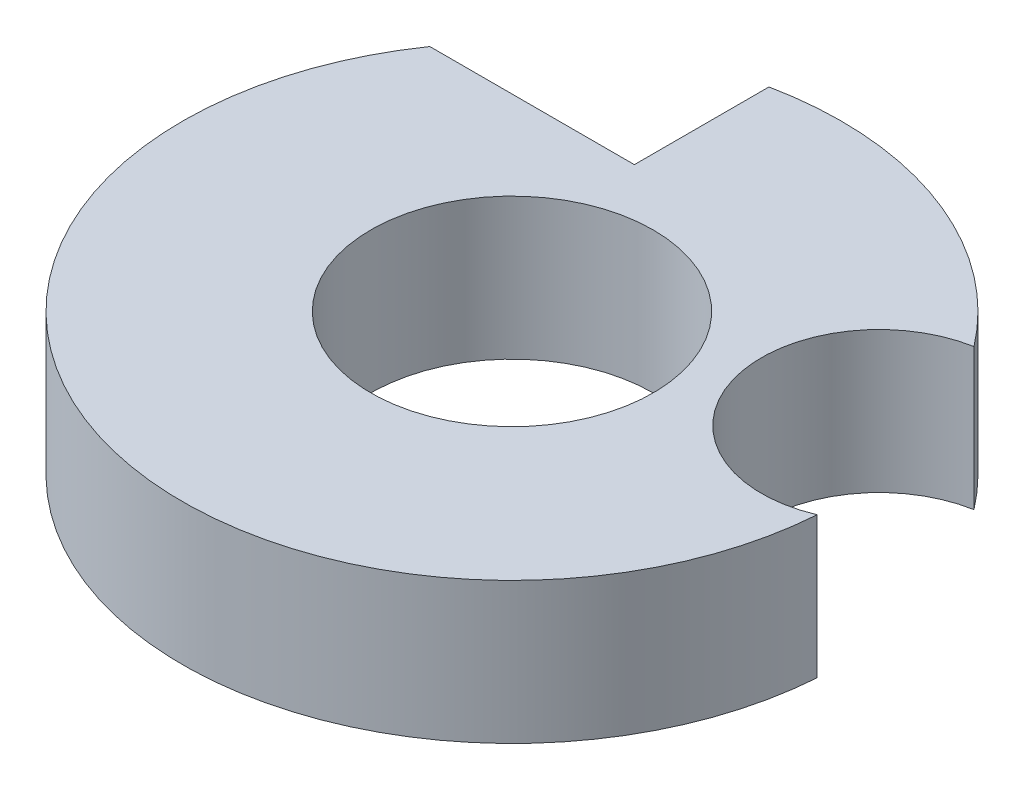
ISO-10303-21;
HEADER;
FILE_DESCRIPTION(('STEP AP214'),'2;1');
FILE_NAME('part.step','',(''),(''),'','','');
FILE_SCHEMA(('AUTOMOTIVE_DESIGN { 1 0 10303 214 1 1 1 1 }'));
ENDSEC;
DATA;
#1=APPLICATION_CONTEXT('core data for automotive mechanical design processes');
#2=APPLICATION_PROTOCOL_DEFINITION('international standard','automotive_design',2000,#1);
#3=PRODUCT_CONTEXT('',#1,'mechanical');
#4=PRODUCT('Part','Part','',(#3));
#5=PRODUCT_RELATED_PRODUCT_CATEGORY('part','',(#4));
#6=PRODUCT_DEFINITION_FORMATION('','',#4);
#7=PRODUCT_DEFINITION_CONTEXT('part definition',#1,'design');
#8=PRODUCT_DEFINITION('design','',#6,#7);
#9=PRODUCT_DEFINITION_SHAPE('','',#8);
#10=(LENGTH_UNIT() NAMED_UNIT(*) SI_UNIT(.MILLI.,.METRE.));
#11=(NAMED_UNIT(*) PLANE_ANGLE_UNIT() SI_UNIT($,.RADIAN.));
#12=(NAMED_UNIT(*) SI_UNIT($,.STERADIAN.) SOLID_ANGLE_UNIT());
#13=UNCERTAINTY_MEASURE_WITH_UNIT(LENGTH_MEASURE(1.E-05),#10,'distance_accuracy_value','');
#14=(GEOMETRIC_REPRESENTATION_CONTEXT(3) GLOBAL_UNCERTAINTY_ASSIGNED_CONTEXT((#13)) GLOBAL_UNIT_ASSIGNED_CONTEXT((#10,
#11,#12)) REPRESENTATION_CONTEXT('',''));
#15=CARTESIAN_POINT('',(0.,0.,0.));
#16=DIRECTION('',(0.,0.,1.));
#17=DIRECTION('',(1.,0.,0.));
#18=AXIS2_PLACEMENT_3D('',#15,#16,#17);
#19=CARTESIAN_POINT('',(0.,0.,0.));
#20=DIRECTION('',(0.,-1.,0.));
#21=DIRECTION('',(0.,0.,-1.));
#22=AXIS2_PLACEMENT_3D('',#19,#20,#21);
#23=CYLINDRICAL_SURFACE('',#22,3.5);
#24=DIRECTION('',(0.,1.,0.));
#25=VECTOR('',#24,1.);
#26=CARTESIAN_POINT('',(3.49109659244381,0.,0.249488641479367));
#27=LINE('',#26,#25);
#28=CARTESIAN_POINT('',(3.49109659244381,0.,0.249488641479367));
#29=VERTEX_POINT('',#28);
#30=CARTESIAN_POINT('',(3.49109659244381,1.5,0.249488641479367));
#31=VERTEX_POINT('',#30);
#32=EDGE_CURVE('E46',#29,#31,#27,.T.);
#33=ORIENTED_EDGE('',*,*,#32,.T.);
#34=CARTESIAN_POINT('',(0.,1.5,0.));
#35=DIRECTION('',(0.,-1.,0.));
#36=DIRECTION('',(0.,0.,-1.));
#37=AXIS2_PLACEMENT_3D('',#34,#35,#36);
#38=CIRCLE('',#37,3.5);
#39=CARTESIAN_POINT('',(-2.87228132326901,1.5,-2.));
#40=VERTEX_POINT('',#39);
#41=EDGE_CURVE('E96',#31,#40,#38,.T.);
#42=ORIENTED_EDGE('',*,*,#41,.T.);
#43=DIRECTION('',(0.,1.,0.));
#44=VECTOR('',#43,1.);
#45=CARTESIAN_POINT('',(-2.87228132326901,0.,-2.));
#46=LINE('',#45,#44);
#47=CARTESIAN_POINT('',(-2.87228132326901,0.,-2.));
#48=VERTEX_POINT('',#47);
#49=EDGE_CURVE('E103',#48,#40,#46,.T.);
#50=ORIENTED_EDGE('',*,*,#49,.F.);
#51=CARTESIAN_POINT('',(0.,0.,0.));
#52=DIRECTION('',(0.,-1.,0.));
#53=DIRECTION('',(0.,0.,-1.));
#54=AXIS2_PLACEMENT_3D('',#51,#52,#53);
#55=CIRCLE('',#54,3.5);
#56=EDGE_CURVE('E97',#29,#48,#55,.T.);
#57=ORIENTED_EDGE('',*,*,#56,.F.);
#58=EDGE_LOOP('',(#33,#42,#50,#57));
#59=FACE_BOUND('',#58,.T.);
#60=ADVANCED_FACE('F31',(#59),#23,.T.);
#61=CARTESIAN_POINT('',(1.5,1.5,0.));
#62=DIRECTION('',(0.,1.,0.));
#63=DIRECTION('',(0.,0.,1.));
#64=AXIS2_PLACEMENT_3D('',#61,#62,#63);
#65=PLANE('',#64);
#66=CARTESIAN_POINT('',(3.,1.5,-0.9));
#67=DIRECTION('',(0.,1.,0.));
#68=DIRECTION('',(0.,0.,1.));
#69=AXIS2_PLACEMENT_3D('',#66,#67,#68);
#70=CIRCLE('',#69,1.25);
#71=CARTESIAN_POINT('',(2.7772520314094,1.5,-2.12999322863533));
#72=VERTEX_POINT('',#71);
#73=EDGE_CURVE('E83',#72,#31,#70,.T.);
#74=ORIENTED_EDGE('',*,*,#73,.F.);
#75=CARTESIAN_POINT('',(-0.7,1.5,-3.42928563989645));
#76=VERTEX_POINT('',#75);
#77=EDGE_CURVE('E39',#76,#72,#38,.T.);
#78=ORIENTED_EDGE('',*,*,#77,.F.);
#79=DIRECTION('',(0.,0.,1.));
#80=VECTOR('',#79,1.);
#81=CARTESIAN_POINT('',(-0.7,1.5,0.));
#82=LINE('',#81,#80);
#83=CARTESIAN_POINT('',(-0.7,1.5,-2.));
#84=VERTEX_POINT('',#83);
#85=EDGE_CURVE('E109',#76,#84,#82,.T.);
#86=ORIENTED_EDGE('',*,*,#85,.T.);
#87=DIRECTION('',(-1.,0.,0.));
#88=VECTOR('',#87,1.);
#89=CARTESIAN_POINT('',(-7.84142135623731,1.5,-2.));
#90=LINE('',#89,#88);
#91=EDGE_CURVE('E113',#84,#40,#90,.T.);
#92=ORIENTED_EDGE('',*,*,#91,.T.);
#93=ORIENTED_EDGE('',*,*,#41,.F.);
#94=EDGE_LOOP('',(#74,#78,#86,#92,#93));
#95=FACE_BOUND('',#94,.T.);
#96=CARTESIAN_POINT('',(0.,1.5,0.));
#97=DIRECTION('',(0.,-1.,0.));
#98=DIRECTION('',(0.,0.,-1.));
#99=AXIS2_PLACEMENT_3D('',#96,#97,#98);
#100=CIRCLE('',#99,1.5);
#101=CARTESIAN_POINT('',(0.,1.5,-1.5));
#102=VERTEX_POINT('',#101);
#103=EDGE_CURVE('E11',#102,#102,#100,.T.);
#104=ORIENTED_EDGE('',*,*,#103,.T.);
#105=EDGE_LOOP('',(#104));
#106=FACE_BOUND('',#105,.T.);
#107=ADVANCED_FACE('F124',(#95,#106),#65,.T.);
#108=DIRECTION('',(0.,1.,0.));
#109=VECTOR('',#108,1.);
#110=CARTESIAN_POINT('',(2.7772520314094,0.,-2.12999322863533));
#111=LINE('',#110,#109);
#112=CARTESIAN_POINT('',(2.7772520314094,0.,-2.12999322863533));
#113=VERTEX_POINT('',#112);
#114=EDGE_CURVE('E78',#113,#72,#111,.T.);
#115=ORIENTED_EDGE('',*,*,#114,.F.);
#116=CARTESIAN_POINT('',(-0.7,0.,-3.42928563989645));
#117=VERTEX_POINT('',#116);
#118=EDGE_CURVE('E89',#117,#113,#55,.T.);
#119=ORIENTED_EDGE('',*,*,#118,.F.);
#120=DIRECTION('',(0.,1.,0.));
#121=VECTOR('',#120,1.);
#122=CARTESIAN_POINT('',(-0.7,0.,-3.42928563989645));
#123=LINE('',#122,#121);
#124=EDGE_CURVE('E54',#117,#76,#123,.T.);
#125=ORIENTED_EDGE('',*,*,#124,.T.);
#126=ORIENTED_EDGE('',*,*,#77,.T.);
#127=EDGE_LOOP('',(#115,#119,#125,#126));
#128=FACE_BOUND('',#127,.T.);
#129=ADVANCED_FACE('F88',(#128),#23,.T.);
#130=CARTESIAN_POINT('',(1.5,0.,0.));
#131=DIRECTION('',(0.,-1.,0.));
#132=DIRECTION('',(0.,0.,-1.));
#133=AXIS2_PLACEMENT_3D('',#130,#131,#132);
#134=PLANE('',#133);
#135=CARTESIAN_POINT('',(3.,0.,-0.9));
#136=DIRECTION('',(0.,1.,0.));
#137=DIRECTION('',(0.,0.,1.));
#138=AXIS2_PLACEMENT_3D('',#135,#136,#137);
#139=CIRCLE('',#138,1.25);
#140=EDGE_CURVE('E75',#113,#29,#139,.T.);
#141=ORIENTED_EDGE('',*,*,#140,.T.);
#142=ORIENTED_EDGE('',*,*,#56,.T.);
#143=DIRECTION('',(-1.,0.,0.));
#144=VECTOR('',#143,1.);
#145=CARTESIAN_POINT('',(-7.84142135623731,0.,-2.));
#146=LINE('',#145,#144);
#147=CARTESIAN_POINT('',(-0.7,0.,-2.));
#148=VERTEX_POINT('',#147);
#149=EDGE_CURVE('E112',#148,#48,#146,.T.);
#150=ORIENTED_EDGE('',*,*,#149,.F.);
#151=DIRECTION('',(0.,0.,1.));
#152=VECTOR('',#151,1.);
#153=CARTESIAN_POINT('',(-0.7,0.,0.));
#154=LINE('',#153,#152);
#155=EDGE_CURVE('E95',#117,#148,#154,.T.);
#156=ORIENTED_EDGE('',*,*,#155,.F.);
#157=ORIENTED_EDGE('',*,*,#118,.T.);
#158=EDGE_LOOP('',(#141,#142,#150,#156,#157));
#159=FACE_BOUND('',#158,.T.);
#160=CARTESIAN_POINT('',(0.,0.,0.));
#161=DIRECTION('',(0.,-1.,0.));
#162=DIRECTION('',(0.,0.,-1.));
#163=AXIS2_PLACEMENT_3D('',#160,#161,#162);
#164=CIRCLE('',#163,1.5);
#165=CARTESIAN_POINT('',(0.,0.,-1.5));
#166=VERTEX_POINT('',#165);
#167=EDGE_CURVE('E99',#166,#166,#164,.T.);
#168=ORIENTED_EDGE('',*,*,#167,.F.);
#169=EDGE_LOOP('',(#168));
#170=FACE_BOUND('',#169,.T.);
#171=ADVANCED_FACE('F92',(#159,#170),#134,.T.);
#172=CARTESIAN_POINT('',(0.,0.,0.));
#173=DIRECTION('',(0.,-1.,0.));
#174=DIRECTION('',(0.,0.,-1.));
#175=AXIS2_PLACEMENT_3D('',#172,#173,#174);
#176=CYLINDRICAL_SURFACE('',#175,1.5);
#177=ORIENTED_EDGE('',*,*,#167,.T.);
#178=EDGE_LOOP('',(#177));
#179=FACE_BOUND('',#178,.T.);
#180=ORIENTED_EDGE('',*,*,#103,.F.);
#181=EDGE_LOOP('',(#180));
#182=FACE_BOUND('',#181,.T.);
#183=ADVANCED_FACE('F33',(#179,#182),#176,.F.);
#184=CARTESIAN_POINT('',(-7.84142135623731,0.,-2.));
#185=DIRECTION('',(0.,0.,-1.));
#186=DIRECTION('',(-1.,0.,0.));
#187=AXIS2_PLACEMENT_3D('',#184,#185,#186);
#188=PLANE('',#187);
#189=ORIENTED_EDGE('',*,*,#91,.F.);
#190=DIRECTION('',(0.,1.,0.));
#191=VECTOR('',#190,1.);
#192=CARTESIAN_POINT('',(-0.7,0.,-2.));
#193=LINE('',#192,#191);
#194=EDGE_CURVE('E104',#148,#84,#193,.T.);
#195=ORIENTED_EDGE('',*,*,#194,.F.);
#196=ORIENTED_EDGE('',*,*,#149,.T.);
#197=ORIENTED_EDGE('',*,*,#49,.T.);
#198=EDGE_LOOP('',(#189,#195,#196,#197));
#199=FACE_BOUND('',#198,.T.);
#200=ADVANCED_FACE('F129',(#199),#188,.T.);
#201=CARTESIAN_POINT('',(-0.7,0.,0.));
#202=DIRECTION('',(-1.,0.,0.));
#203=DIRECTION('',(0.,0.,1.));
#204=AXIS2_PLACEMENT_3D('',#201,#202,#203);
#205=PLANE('',#204);
#206=ORIENTED_EDGE('',*,*,#85,.F.);
#207=ORIENTED_EDGE('',*,*,#124,.F.);
#208=ORIENTED_EDGE('',*,*,#155,.T.);
#209=ORIENTED_EDGE('',*,*,#194,.T.);
#210=EDGE_LOOP('',(#206,#207,#208,#209));
#211=FACE_BOUND('',#210,.T.);
#212=ADVANCED_FACE('F130',(#211),#205,.T.);
#213=CARTESIAN_POINT('',(3.,0.,-0.9));
#214=DIRECTION('',(0.,1.,0.));
#215=DIRECTION('',(0.,0.,1.));
#216=AXIS2_PLACEMENT_3D('',#213,#214,#215);
#217=CYLINDRICAL_SURFACE('',#216,1.25);
#218=ORIENTED_EDGE('',*,*,#73,.T.);
#219=ORIENTED_EDGE('',*,*,#32,.F.);
#220=ORIENTED_EDGE('',*,*,#140,.F.);
#221=ORIENTED_EDGE('',*,*,#114,.T.);
#222=EDGE_LOOP('',(#218,#219,#220,#221));
#223=FACE_BOUND('',#222,.T.);
#224=ADVANCED_FACE('F77',(#223),#217,.F.);
#225=CLOSED_SHELL('',(#60,#107,#129,#171,#183,#200,#212,#224));
#226=MANIFOLD_SOLID_BREP('B2',#225);
#227=ADVANCED_BREP_SHAPE_REPRESENTATION('',(#18,#226),#14);
#228=SHAPE_DEFINITION_REPRESENTATION(#9,#227);
ENDSEC;
END-ISO-10303-21;
